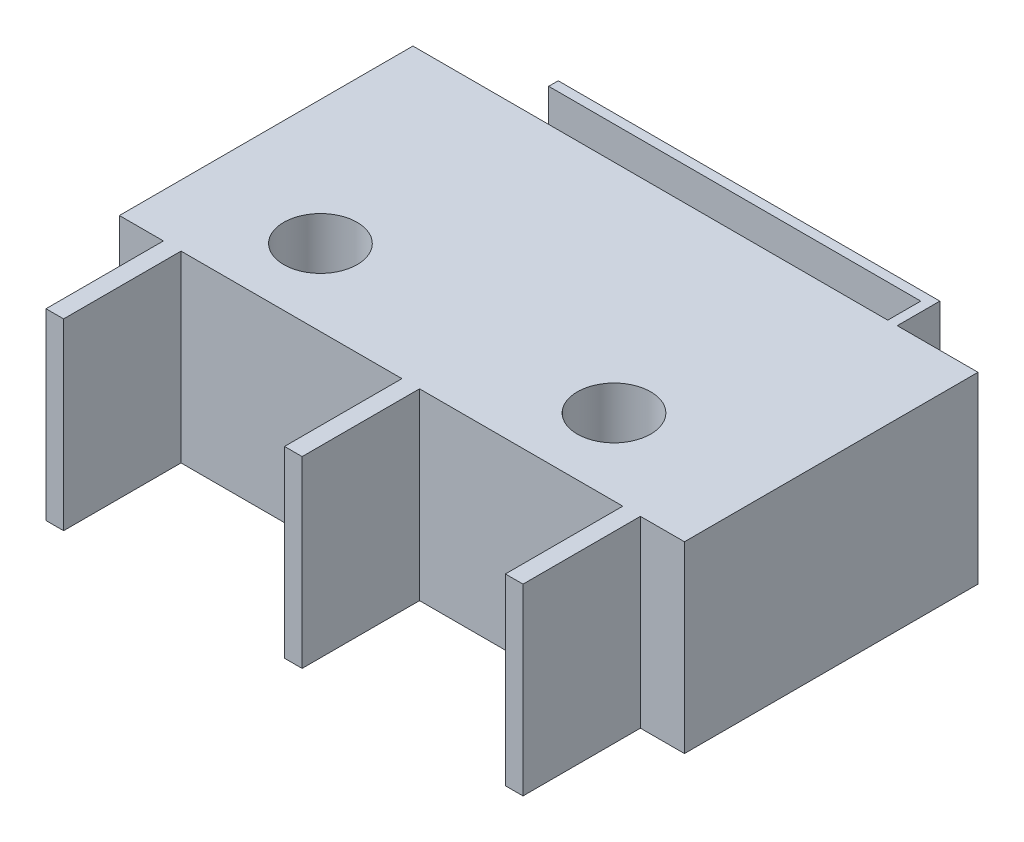
ISO-10303-21;
HEADER;
FILE_DESCRIPTION(('STEP AP214'),'2;1');
FILE_NAME('part.step','',(''),(''),'','','');
FILE_SCHEMA(('AUTOMOTIVE_DESIGN { 1 0 10303 214 1 1 1 1 }'));
ENDSEC;
DATA;
#1=APPLICATION_CONTEXT('core data for automotive mechanical design processes');
#2=APPLICATION_PROTOCOL_DEFINITION('international standard','automotive_design',2000,#1);
#3=PRODUCT_CONTEXT('',#1,'mechanical');
#4=PRODUCT('Part','Part','',(#3));
#5=PRODUCT_RELATED_PRODUCT_CATEGORY('part','',(#4));
#6=PRODUCT_DEFINITION_FORMATION('','',#4);
#7=PRODUCT_DEFINITION_CONTEXT('part definition',#1,'design');
#8=PRODUCT_DEFINITION('design','',#6,#7);
#9=PRODUCT_DEFINITION_SHAPE('','',#8);
#10=(LENGTH_UNIT() NAMED_UNIT(*) SI_UNIT(.MILLI.,.METRE.));
#11=(NAMED_UNIT(*) PLANE_ANGLE_UNIT() SI_UNIT($,.RADIAN.));
#12=(NAMED_UNIT(*) SI_UNIT($,.STERADIAN.) SOLID_ANGLE_UNIT());
#13=UNCERTAINTY_MEASURE_WITH_UNIT(LENGTH_MEASURE(1.E-05),#10,'distance_accuracy_value','');
#14=(GEOMETRIC_REPRESENTATION_CONTEXT(3) GLOBAL_UNCERTAINTY_ASSIGNED_CONTEXT((#13)) GLOBAL_UNIT_ASSIGNED_CONTEXT((#10,
#11,#12)) REPRESENTATION_CONTEXT('',''));
#15=CARTESIAN_POINT('',(0.,0.,0.));
#16=DIRECTION('',(0.,0.,1.));
#17=DIRECTION('',(1.,0.,0.));
#18=AXIS2_PLACEMENT_3D('',#15,#16,#17);
#19=CARTESIAN_POINT('',(0.313764077301954,6.35,-11.3770561101226));
#20=DIRECTION('',(0.,0.,-1.));
#21=DIRECTION('',(-1.,0.,0.));
#22=AXIS2_PLACEMENT_3D('',#19,#20,#21);
#23=PLANE('',#22);
#24=DIRECTION('',(1.,0.,0.));
#25=VECTOR('',#24,1.);
#26=CARTESIAN_POINT('',(0.313764077301954,6.35,-11.3770561101226));
#27=LINE('',#26,#25);
#28=CARTESIAN_POINT('',(0.313764077301954,6.35,-11.3770561101226));
#29=VERTEX_POINT('',#28);
#30=CARTESIAN_POINT('',(16.7475640773019,6.35,-11.3770561101226));
#31=VERTEX_POINT('',#30);
#32=EDGE_CURVE('E160',#29,#31,#27,.T.);
#33=ORIENTED_EDGE('',*,*,#32,.T.);
#34=DIRECTION('',(0.,-1.,0.));
#35=VECTOR('',#34,1.);
#36=CARTESIAN_POINT('',(16.7475640773019,6.35,-11.3770561101226));
#37=LINE('',#36,#35);
#38=CARTESIAN_POINT('',(16.7475640773019,0.,-11.3770561101226));
#39=VERTEX_POINT('',#38);
#40=EDGE_CURVE('E174',#31,#39,#37,.T.);
#41=ORIENTED_EDGE('',*,*,#40,.T.);
#42=DIRECTION('',(1.,0.,0.));
#43=VECTOR('',#42,1.);
#44=CARTESIAN_POINT('',(0.313764077301954,0.,-11.3770561101226));
#45=LINE('',#44,#43);
#46=CARTESIAN_POINT('',(0.313764077301954,0.,-11.3770561101226));
#47=VERTEX_POINT('',#46);
#48=EDGE_CURVE('E166',#47,#39,#45,.T.);
#49=ORIENTED_EDGE('',*,*,#48,.F.);
#50=DIRECTION('',(0.,-1.,0.));
#51=VECTOR('',#50,1.);
#52=CARTESIAN_POINT('',(0.313764077301954,6.35,-11.3770561101226));
#53=LINE('',#52,#51);
#54=EDGE_CURVE('E149',#29,#47,#53,.T.);
#55=ORIENTED_EDGE('',*,*,#54,.F.);
#56=EDGE_LOOP('',(#33,#41,#49,#55));
#57=FACE_BOUND('',#56,.T.);
#58=ADVANCED_FACE('F32',(#57),#23,.T.);
#59=CARTESIAN_POINT('',(17.738164077302,6.35,-1.2170561101226));
#60=DIRECTION('',(1.,0.,0.));
#61=DIRECTION('',(0.,0.,-1.));
#62=AXIS2_PLACEMENT_3D('',#59,#60,#61);
#63=PLANE('',#62);
#64=DIRECTION('',(0.,0.,1.));
#65=VECTOR('',#64,1.);
#66=CARTESIAN_POINT('',(17.738164077302,0.,-1.2170561101226));
#67=LINE('',#66,#65);
#68=CARTESIAN_POINT('',(17.738164077302,0.,-1.2170561101226));
#69=VERTEX_POINT('',#68);
#70=CARTESIAN_POINT('',(17.738164077302,0.,2.8469438898774));
#71=VERTEX_POINT('',#70);
#72=EDGE_CURVE('E234',#69,#71,#67,.T.);
#73=ORIENTED_EDGE('',*,*,#72,.T.);
#74=DIRECTION('',(0.,-1.,0.));
#75=VECTOR('',#74,1.);
#76=CARTESIAN_POINT('',(17.738164077302,6.35,2.8469438898774));
#77=LINE('',#76,#75);
#78=CARTESIAN_POINT('',(17.738164077302,6.35,2.8469438898774));
#79=VERTEX_POINT('',#78);
#80=EDGE_CURVE('E41',#79,#71,#77,.T.);
#81=ORIENTED_EDGE('',*,*,#80,.F.);
#82=DIRECTION('',(0.,0.,1.));
#83=VECTOR('',#82,1.);
#84=CARTESIAN_POINT('',(17.738164077302,6.35,-1.2170561101226));
#85=LINE('',#84,#83);
#86=CARTESIAN_POINT('',(17.738164077302,6.35,-1.2170561101226));
#87=VERTEX_POINT('',#86);
#88=EDGE_CURVE('E255',#87,#79,#85,.T.);
#89=ORIENTED_EDGE('',*,*,#88,.F.);
#90=DIRECTION('',(0.,-1.,0.));
#91=VECTOR('',#90,1.);
#92=CARTESIAN_POINT('',(17.738164077302,6.35,-1.2170561101226));
#93=LINE('',#92,#91);
#94=EDGE_CURVE('E11',#87,#69,#93,.T.);
#95=ORIENTED_EDGE('',*,*,#94,.T.);
#96=EDGE_LOOP('',(#73,#81,#89,#95));
#97=FACE_BOUND('',#96,.T.);
#98=ADVANCED_FACE('F423',(#97),#63,.F.);
#99=CARTESIAN_POINT('',(17.738164077302,6.35,2.8469438898774));
#100=DIRECTION('',(0.,0.,-1.));
#101=DIRECTION('',(-1.,0.,0.));
#102=AXIS2_PLACEMENT_3D('',#99,#100,#101);
#103=PLANE('',#102);
#104=DIRECTION('',(1.,0.,0.));
#105=VECTOR('',#104,1.);
#106=CARTESIAN_POINT('',(17.738164077302,0.,2.8469438898774));
#107=LINE('',#106,#105);
#108=CARTESIAN_POINT('',(18.347764077302,0.,2.8469438898774));
#109=VERTEX_POINT('',#108);
#110=EDGE_CURVE('E237',#71,#109,#107,.T.);
#111=ORIENTED_EDGE('',*,*,#110,.T.);
#112=DIRECTION('',(0.,-1.,0.));
#113=VECTOR('',#112,1.);
#114=CARTESIAN_POINT('',(18.347764077302,6.35,2.8469438898774));
#115=LINE('',#114,#113);
#116=CARTESIAN_POINT('',(18.347764077302,6.35,2.8469438898774));
#117=VERTEX_POINT('',#116);
#118=EDGE_CURVE('E251',#117,#109,#115,.T.);
#119=ORIENTED_EDGE('',*,*,#118,.F.);
#120=DIRECTION('',(1.,0.,0.));
#121=VECTOR('',#120,1.);
#122=CARTESIAN_POINT('',(17.738164077302,6.35,2.8469438898774));
#123=LINE('',#122,#121);
#124=EDGE_CURVE('E244',#79,#117,#123,.T.);
#125=ORIENTED_EDGE('',*,*,#124,.F.);
#126=ORIENTED_EDGE('',*,*,#80,.T.);
#127=EDGE_LOOP('',(#111,#119,#125,#126));
#128=FACE_BOUND('',#127,.T.);
#129=ADVANCED_FACE('F350',(#128),#103,.F.);
#130=CARTESIAN_POINT('',(18.347764077302,6.35,-1.2170561101226));
#131=DIRECTION('',(1.,0.,0.));
#132=DIRECTION('',(0.,0.,-1.));
#133=AXIS2_PLACEMENT_3D('',#130,#131,#132);
#134=PLANE('',#133);
#135=DIRECTION('',(0.,0.,1.));
#136=VECTOR('',#135,1.);
#137=CARTESIAN_POINT('',(18.347764077302,0.,-1.2170561101226));
#138=LINE('',#137,#136);
#139=CARTESIAN_POINT('',(18.347764077302,0.,-1.2170561101226));
#140=VERTEX_POINT('',#139);
#141=EDGE_CURVE('E246',#140,#109,#138,.T.);
#142=ORIENTED_EDGE('',*,*,#141,.F.);
#143=DIRECTION('',(0.,-1.,0.));
#144=VECTOR('',#143,1.);
#145=CARTESIAN_POINT('',(18.347764077302,6.35,-1.2170561101226));
#146=LINE('',#145,#144);
#147=CARTESIAN_POINT('',(18.347764077302,6.35,-1.2170561101226));
#148=VERTEX_POINT('',#147);
#149=EDGE_CURVE('E253',#148,#140,#146,.T.);
#150=ORIENTED_EDGE('',*,*,#149,.F.);
#151=DIRECTION('',(0.,0.,1.));
#152=VECTOR('',#151,1.);
#153=CARTESIAN_POINT('',(18.347764077302,6.35,-1.2170561101226));
#154=LINE('',#153,#152);
#155=EDGE_CURVE('E241',#148,#117,#154,.T.);
#156=ORIENTED_EDGE('',*,*,#155,.T.);
#157=ORIENTED_EDGE('',*,*,#118,.T.);
#158=EDGE_LOOP('',(#142,#150,#156,#157));
#159=FACE_BOUND('',#158,.T.);
#160=ADVANCED_FACE('F353',(#159),#134,.T.);
#161=CARTESIAN_POINT('',(0.,0.,0.));
#162=DIRECTION('',(0.,-1.,0.));
#163=DIRECTION('',(0.,0.,-1.));
#164=AXIS2_PLACEMENT_3D('',#161,#162,#163);
#165=PLANE('',#164);
#166=CARTESIAN_POINT('',(4.63176407730195,0.,-3.85841360171425));
#167=DIRECTION('',(0.,1.,0.));
#168=DIRECTION('',(0.,0.,1.));
#169=AXIS2_PLACEMENT_3D('',#166,#167,#168);
#170=CIRCLE('',#169,1.27);
#171=CARTESIAN_POINT('',(4.63176407730195,0.,-2.58841360171425));
#172=VERTEX_POINT('',#171);
#173=EDGE_CURVE('E172',#172,#172,#170,.T.);
#174=ORIENTED_EDGE('',*,*,#173,.T.);
#175=EDGE_LOOP('',(#174));
#176=FACE_BOUND('',#175,.T.);
#177=CARTESIAN_POINT('',(14.791764077302,0.,-3.85841360171425));
#178=DIRECTION('',(0.,1.,0.));
#179=DIRECTION('',(0.,0.,1.));
#180=AXIS2_PLACEMENT_3D('',#177,#178,#179);
#181=CIRCLE('',#180,1.27);
#182=CARTESIAN_POINT('',(14.791764077302,0.,-2.58841360171425));
#183=VERTEX_POINT('',#182);
#184=EDGE_CURVE('E396',#183,#183,#181,.T.);
#185=ORIENTED_EDGE('',*,*,#184,.T.);
#186=EDGE_LOOP('',(#185));
#187=FACE_BOUND('',#186,.T.);
#188=ORIENTED_EDGE('',*,*,#72,.F.);
#189=DIRECTION('',(1.,0.,0.));
#190=VECTOR('',#189,1.);
#191=CARTESIAN_POINT('',(0.313764077301955,0.,-1.2170561101226));
#192=LINE('',#191,#190);
#193=CARTESIAN_POINT('',(10.702364077302,0.,-1.2170561101226));
#194=VERTEX_POINT('',#193);
#195=EDGE_CURVE('E225',#194,#69,#192,.T.);
#196=ORIENTED_EDGE('',*,*,#195,.F.);
#197=DIRECTION('',(0.,0.,1.));
#198=VECTOR('',#197,1.);
#199=CARTESIAN_POINT('',(10.702364077302,0.,-1.2170561101226));
#200=LINE('',#199,#198);
#201=CARTESIAN_POINT('',(10.702364077302,0.,2.8469438898774));
#202=VERTEX_POINT('',#201);
#203=EDGE_CURVE('E209',#194,#202,#200,.T.);
#204=ORIENTED_EDGE('',*,*,#203,.T.);
#205=DIRECTION('',(1.,0.,0.));
#206=VECTOR('',#205,1.);
#207=CARTESIAN_POINT('',(10.092764077302,0.,2.8469438898774));
#208=LINE('',#207,#206);
#209=CARTESIAN_POINT('',(10.092764077302,0.,2.8469438898774));
#210=VERTEX_POINT('',#209);
#211=EDGE_CURVE('E265',#210,#202,#208,.T.);
#212=ORIENTED_EDGE('',*,*,#211,.F.);
#213=DIRECTION('',(0.,0.,1.));
#214=VECTOR('',#213,1.);
#215=CARTESIAN_POINT('',(10.092764077302,0.,-1.2170561101226));
#216=LINE('',#215,#214);
#217=CARTESIAN_POINT('',(10.092764077302,0.,-1.2170561101226));
#218=VERTEX_POINT('',#217);
#219=EDGE_CURVE('E260',#218,#210,#216,.T.);
#220=ORIENTED_EDGE('',*,*,#219,.F.);
#221=CARTESIAN_POINT('',(2.44736407730195,0.,-1.2170561101226));
#222=VERTEX_POINT('',#221);
#223=EDGE_CURVE('E223',#222,#218,#192,.T.);
#224=ORIENTED_EDGE('',*,*,#223,.F.);
#225=DIRECTION('',(0.,0.,-1.));
#226=VECTOR('',#225,1.);
#227=CARTESIAN_POINT('',(2.44736407730195,0.,2.8469438898774));
#228=LINE('',#227,#226);
#229=CARTESIAN_POINT('',(2.44736407730195,0.,2.8469438898774));
#230=VERTEX_POINT('',#229);
#231=EDGE_CURVE('E198',#230,#222,#228,.T.);
#232=ORIENTED_EDGE('',*,*,#231,.F.);
#233=DIRECTION('',(-1.,0.,0.));
#234=VECTOR('',#233,1.);
#235=CARTESIAN_POINT('',(2.44736407730195,0.,2.8469438898774));
#236=LINE('',#235,#234);
#237=CARTESIAN_POINT('',(1.83776407730196,0.,2.8469438898774));
#238=VERTEX_POINT('',#237);
#239=EDGE_CURVE('E191',#230,#238,#236,.T.);
#240=ORIENTED_EDGE('',*,*,#239,.T.);
#241=DIRECTION('',(0.,0.,-1.));
#242=VECTOR('',#241,1.);
#243=CARTESIAN_POINT('',(1.83776407730196,0.,2.8469438898774));
#244=LINE('',#243,#242);
#245=CARTESIAN_POINT('',(1.83776407730196,0.,-1.2170561101226));
#246=VERTEX_POINT('',#245);
#247=EDGE_CURVE('E194',#238,#246,#244,.T.);
#248=ORIENTED_EDGE('',*,*,#247,.T.);
#249=CARTESIAN_POINT('',(0.313764077301955,0.,-1.2170561101226));
#250=VERTEX_POINT('',#249);
#251=EDGE_CURVE('E169',#250,#246,#192,.T.);
#252=ORIENTED_EDGE('',*,*,#251,.F.);
#253=DIRECTION('',(0.,0.,1.));
#254=VECTOR('',#253,1.);
#255=CARTESIAN_POINT('',(0.313764077301954,0.,-11.3770561101226));
#256=LINE('',#255,#254);
#257=EDGE_CURVE('E152',#47,#250,#256,.T.);
#258=ORIENTED_EDGE('',*,*,#257,.F.);
#259=ORIENTED_EDGE('',*,*,#48,.T.);
#260=DIRECTION('',(0.,0.,-1.));
#261=VECTOR('',#260,1.);
#262=CARTESIAN_POINT('',(16.7475640773019,0.,-11.3770561101226));
#263=LINE('',#262,#261);
#264=CARTESIAN_POINT('',(16.7475640773019,0.,-12.5200561101226));
#265=VERTEX_POINT('',#264);
#266=EDGE_CURVE('E49',#39,#265,#263,.T.);
#267=ORIENTED_EDGE('',*,*,#266,.T.);
#268=DIRECTION('',(-1.,0.,0.));
#269=VECTOR('',#268,1.);
#270=CARTESIAN_POINT('',(17.0777640773019,0.,-12.5200561101226));
#271=LINE('',#270,#269);
#272=CARTESIAN_POINT('',(3.86976407730195,0.,-12.5200561101226));
#273=VERTEX_POINT('',#272);
#274=EDGE_CURVE('E378',#265,#273,#271,.T.);
#275=ORIENTED_EDGE('',*,*,#274,.T.);
#276=DIRECTION('',(0.,0.,-1.));
#277=VECTOR('',#276,1.);
#278=CARTESIAN_POINT('',(3.86976407730195,0.,-12.5200561101226));
#279=LINE('',#278,#277);
#280=CARTESIAN_POINT('',(3.86976407730195,0.,-12.8502561101226));
#281=VERTEX_POINT('',#280);
#282=EDGE_CURVE('E385',#273,#281,#279,.T.);
#283=ORIENTED_EDGE('',*,*,#282,.T.);
#284=DIRECTION('',(-1.,0.,0.));
#285=VECTOR('',#284,1.);
#286=CARTESIAN_POINT('',(17.0777640773019,0.,-12.8502561101226));
#287=LINE('',#286,#285);
#288=CARTESIAN_POINT('',(17.0777640773019,0.,-12.8502561101226));
#289=VERTEX_POINT('',#288);
#290=EDGE_CURVE('E359',#289,#281,#287,.T.);
#291=ORIENTED_EDGE('',*,*,#290,.F.);
#292=DIRECTION('',(0.,0.,-1.));
#293=VECTOR('',#292,1.);
#294=CARTESIAN_POINT('',(17.0777640773019,0.,-11.3770561101226));
#295=LINE('',#294,#293);
#296=CARTESIAN_POINT('',(17.0777640773019,0.,-11.3770561101226));
#297=VERTEX_POINT('',#296);
#298=EDGE_CURVE('E356',#297,#289,#295,.T.);
#299=ORIENTED_EDGE('',*,*,#298,.F.);
#300=CARTESIAN_POINT('',(19.871764077302,0.,-11.3770561101226));
#301=VERTEX_POINT('',#300);
#302=EDGE_CURVE('E175',#297,#301,#45,.T.);
#303=ORIENTED_EDGE('',*,*,#302,.T.);
#304=DIRECTION('',(0.,0.,1.));
#305=VECTOR('',#304,1.);
#306=CARTESIAN_POINT('',(19.871764077302,0.,-11.3770561101226));
#307=LINE('',#306,#305);
#308=CARTESIAN_POINT('',(19.871764077302,0.,-1.2170561101226));
#309=VERTEX_POINT('',#308);
#310=EDGE_CURVE('E179',#301,#309,#307,.T.);
#311=ORIENTED_EDGE('',*,*,#310,.T.);
#312=EDGE_CURVE('E171',#140,#309,#192,.T.);
#313=ORIENTED_EDGE('',*,*,#312,.F.);
#314=ORIENTED_EDGE('',*,*,#141,.T.);
#315=ORIENTED_EDGE('',*,*,#110,.F.);
#316=EDGE_LOOP('',(#188,#196,#204,#212,#220,#224,#232,#240,#248,#252,#258,#259,#267,#275,#283,
#291,#299,#303,#311,#313,#314,#315));
#317=FACE_BOUND('',#316,.T.);
#318=ADVANCED_FACE('F165',(#176,#187,#317),#165,.T.);
#319=CARTESIAN_POINT('',(0.,6.35,0.));
#320=DIRECTION('',(0.,-1.,0.));
#321=DIRECTION('',(0.,0.,-1.));
#322=AXIS2_PLACEMENT_3D('',#319,#320,#321);
#323=PLANE('',#322);
#324=CARTESIAN_POINT('',(4.63176407730195,6.35,-3.85841360171425));
#325=DIRECTION('',(0.,1.,0.));
#326=DIRECTION('',(0.,0.,1.));
#327=AXIS2_PLACEMENT_3D('',#324,#325,#326);
#328=CIRCLE('',#327,1.27);
#329=CARTESIAN_POINT('',(4.63176407730195,6.35,-2.58841360171425));
#330=VERTEX_POINT('',#329);
#331=EDGE_CURVE('E393',#330,#330,#328,.T.);
#332=ORIENTED_EDGE('',*,*,#331,.F.);
#333=EDGE_LOOP('',(#332));
#334=FACE_BOUND('',#333,.T.);
#335=CARTESIAN_POINT('',(14.791764077302,6.35,-3.85841360171425));
#336=DIRECTION('',(0.,1.,0.));
#337=DIRECTION('',(0.,0.,1.));
#338=AXIS2_PLACEMENT_3D('',#335,#336,#337);
#339=CIRCLE('',#338,1.27);
#340=CARTESIAN_POINT('',(14.791764077302,6.35,-2.58841360171425));
#341=VERTEX_POINT('',#340);
#342=EDGE_CURVE('E374',#341,#341,#339,.T.);
#343=ORIENTED_EDGE('',*,*,#342,.F.);
#344=EDGE_LOOP('',(#343));
#345=FACE_BOUND('',#344,.T.);
#346=ORIENTED_EDGE('',*,*,#155,.F.);
#347=DIRECTION('',(1.,0.,0.));
#348=VECTOR('',#347,1.);
#349=CARTESIAN_POINT('',(0.313764077301955,6.35,-1.2170561101226));
#350=LINE('',#349,#348);
#351=CARTESIAN_POINT('',(19.871764077302,6.35,-1.2170561101226));
#352=VERTEX_POINT('',#351);
#353=EDGE_CURVE('E177',#148,#352,#350,.T.);
#354=ORIENTED_EDGE('',*,*,#353,.T.);
#355=DIRECTION('',(0.,0.,1.));
#356=VECTOR('',#355,1.);
#357=CARTESIAN_POINT('',(19.871764077302,6.35,-11.3770561101226));
#358=LINE('',#357,#356);
#359=CARTESIAN_POINT('',(19.871764077302,6.35,-11.3770561101226));
#360=VERTEX_POINT('',#359);
#361=EDGE_CURVE('E219',#360,#352,#358,.T.);
#362=ORIENTED_EDGE('',*,*,#361,.F.);
#363=CARTESIAN_POINT('',(17.0777640773019,6.35,-11.3770561101226));
#364=VERTEX_POINT('',#363);
#365=EDGE_CURVE('E222',#364,#360,#27,.T.);
#366=ORIENTED_EDGE('',*,*,#365,.F.);
#367=DIRECTION('',(0.,0.,-1.));
#368=VECTOR('',#367,1.);
#369=CARTESIAN_POINT('',(17.0777640773019,6.35,-11.3770561101226));
#370=LINE('',#369,#368);
#371=CARTESIAN_POINT('',(17.0777640773019,6.35,-12.8502561101226));
#372=VERTEX_POINT('',#371);
#373=EDGE_CURVE('E317',#364,#372,#370,.T.);
#374=ORIENTED_EDGE('',*,*,#373,.T.);
#375=DIRECTION('',(-1.,0.,0.));
#376=VECTOR('',#375,1.);
#377=CARTESIAN_POINT('',(17.0777640773019,6.35,-12.8502561101226));
#378=LINE('',#377,#376);
#379=CARTESIAN_POINT('',(3.86976407730195,6.35,-12.8502561101226));
#380=VERTEX_POINT('',#379);
#381=EDGE_CURVE('E375',#372,#380,#378,.T.);
#382=ORIENTED_EDGE('',*,*,#381,.T.);
#383=DIRECTION('',(0.,0.,-1.));
#384=VECTOR('',#383,1.);
#385=CARTESIAN_POINT('',(3.86976407730195,6.35,-12.5200561101226));
#386=LINE('',#385,#384);
#387=CARTESIAN_POINT('',(3.86976407730195,6.35,-12.5200561101226));
#388=VERTEX_POINT('',#387);
#389=EDGE_CURVE('E377',#388,#380,#386,.T.);
#390=ORIENTED_EDGE('',*,*,#389,.F.);
#391=DIRECTION('',(-1.,0.,0.));
#392=VECTOR('',#391,1.);
#393=CARTESIAN_POINT('',(17.0777640773019,6.35,-12.5200561101226));
#394=LINE('',#393,#392);
#395=CARTESIAN_POINT('',(16.7475640773019,6.35,-12.5200561101226));
#396=VERTEX_POINT('',#395);
#397=EDGE_CURVE('E381',#396,#388,#394,.T.);
#398=ORIENTED_EDGE('',*,*,#397,.F.);
#399=DIRECTION('',(0.,0.,-1.));
#400=VECTOR('',#399,1.);
#401=CARTESIAN_POINT('',(16.7475640773019,6.35,-11.3770561101226));
#402=LINE('',#401,#400);
#403=EDGE_CURVE('E367',#31,#396,#402,.T.);
#404=ORIENTED_EDGE('',*,*,#403,.F.);
#405=ORIENTED_EDGE('',*,*,#32,.F.);
#406=DIRECTION('',(0.,0.,1.));
#407=VECTOR('',#406,1.);
#408=CARTESIAN_POINT('',(0.313764077301954,6.35,-11.3770561101226));
#409=LINE('',#408,#407);
#410=CARTESIAN_POINT('',(0.313764077301955,6.35,-1.2170561101226));
#411=VERTEX_POINT('',#410);
#412=EDGE_CURVE('E154',#29,#411,#409,.T.);
#413=ORIENTED_EDGE('',*,*,#412,.T.);
#414=CARTESIAN_POINT('',(1.83776407730196,6.35,-1.2170561101226));
#415=VERTEX_POINT('',#414);
#416=EDGE_CURVE('E216',#411,#415,#350,.T.);
#417=ORIENTED_EDGE('',*,*,#416,.T.);
#418=DIRECTION('',(0.,0.,-1.));
#419=VECTOR('',#418,1.);
#420=CARTESIAN_POINT('',(1.83776407730196,6.35,2.8469438898774));
#421=LINE('',#420,#419);
#422=CARTESIAN_POINT('',(1.83776407730196,6.35,2.8469438898774));
#423=VERTEX_POINT('',#422);
#424=EDGE_CURVE('E278',#423,#415,#421,.T.);
#425=ORIENTED_EDGE('',*,*,#424,.F.);
#426=DIRECTION('',(-1.,0.,0.));
#427=VECTOR('',#426,1.);
#428=CARTESIAN_POINT('',(2.44736407730195,6.35,2.8469438898774));
#429=LINE('',#428,#427);
#430=CARTESIAN_POINT('',(2.44736407730195,6.35,2.8469438898774));
#431=VERTEX_POINT('',#430);
#432=EDGE_CURVE('E206',#431,#423,#429,.T.);
#433=ORIENTED_EDGE('',*,*,#432,.F.);
#434=DIRECTION('',(0.,0.,-1.));
#435=VECTOR('',#434,1.);
#436=CARTESIAN_POINT('',(2.44736407730195,6.35,2.8469438898774));
#437=LINE('',#436,#435);
#438=CARTESIAN_POINT('',(2.44736407730195,6.35,-1.2170561101226));
#439=VERTEX_POINT('',#438);
#440=EDGE_CURVE('E201',#431,#439,#437,.T.);
#441=ORIENTED_EDGE('',*,*,#440,.T.);
#442=CARTESIAN_POINT('',(10.092764077302,6.35,-1.2170561101226));
#443=VERTEX_POINT('',#442);
#444=EDGE_CURVE('E220',#439,#443,#350,.T.);
#445=ORIENTED_EDGE('',*,*,#444,.T.);
#446=DIRECTION('',(0.,0.,1.));
#447=VECTOR('',#446,1.);
#448=CARTESIAN_POINT('',(10.092764077302,6.35,-1.2170561101226));
#449=LINE('',#448,#447);
#450=CARTESIAN_POINT('',(10.092764077302,6.35,2.8469438898774));
#451=VERTEX_POINT('',#450);
#452=EDGE_CURVE('E262',#443,#451,#449,.T.);
#453=ORIENTED_EDGE('',*,*,#452,.T.);
#454=DIRECTION('',(1.,0.,0.));
#455=VECTOR('',#454,1.);
#456=CARTESIAN_POINT('',(10.092764077302,6.35,2.8469438898774));
#457=LINE('',#456,#455);
#458=CARTESIAN_POINT('',(10.702364077302,6.35,2.8469438898774));
#459=VERTEX_POINT('',#458);
#460=EDGE_CURVE('E259',#451,#459,#457,.T.);
#461=ORIENTED_EDGE('',*,*,#460,.T.);
#462=DIRECTION('',(0.,0.,1.));
#463=VECTOR('',#462,1.);
#464=CARTESIAN_POINT('',(10.702364077302,6.35,-1.2170561101226));
#465=LINE('',#464,#463);
#466=CARTESIAN_POINT('',(10.702364077302,6.35,-1.2170561101226));
#467=VERTEX_POINT('',#466);
#468=EDGE_CURVE('E256',#467,#459,#465,.T.);
#469=ORIENTED_EDGE('',*,*,#468,.F.);
#470=EDGE_CURVE('E296',#467,#87,#350,.T.);
#471=ORIENTED_EDGE('',*,*,#470,.T.);
#472=ORIENTED_EDGE('',*,*,#88,.T.);
#473=ORIENTED_EDGE('',*,*,#124,.T.);
#474=EDGE_LOOP('',(#346,#354,#362,#366,#374,#382,#390,#398,#404,#405,#413,#417,#425,#433,#441,
#445,#453,#461,#469,#471,#472,#473));
#475=FACE_BOUND('',#474,.T.);
#476=ADVANCED_FACE('F288',(#334,#345,#475),#323,.F.);
#477=CARTESIAN_POINT('',(1.83776407730196,6.35,2.8469438898774));
#478=DIRECTION('',(-1.,0.,0.));
#479=DIRECTION('',(0.,0.,1.));
#480=AXIS2_PLACEMENT_3D('',#477,#478,#479);
#481=PLANE('',#480);
#482=ORIENTED_EDGE('',*,*,#247,.F.);
#483=DIRECTION('',(0.,-1.,0.));
#484=VECTOR('',#483,1.);
#485=CARTESIAN_POINT('',(1.83776407730196,6.35,2.8469438898774));
#486=LINE('',#485,#484);
#487=EDGE_CURVE('E214',#423,#238,#486,.T.);
#488=ORIENTED_EDGE('',*,*,#487,.F.);
#489=ORIENTED_EDGE('',*,*,#424,.T.);
#490=DIRECTION('',(0.,-1.,0.));
#491=VECTOR('',#490,1.);
#492=CARTESIAN_POINT('',(1.83776407730196,6.35,-1.2170561101226));
#493=LINE('',#492,#491);
#494=EDGE_CURVE('E212',#415,#246,#493,.T.);
#495=ORIENTED_EDGE('',*,*,#494,.T.);
#496=EDGE_LOOP('',(#482,#488,#489,#495));
#497=FACE_BOUND('',#496,.T.);
#498=ADVANCED_FACE('F406',(#497),#481,.T.);
#499=CARTESIAN_POINT('',(2.44736407730195,6.35,2.8469438898774));
#500=DIRECTION('',(0.,0.,1.));
#501=DIRECTION('',(1.,0.,0.));
#502=AXIS2_PLACEMENT_3D('',#499,#500,#501);
#503=PLANE('',#502);
#504=ORIENTED_EDGE('',*,*,#239,.F.);
#505=DIRECTION('',(0.,-1.,0.));
#506=VECTOR('',#505,1.);
#507=CARTESIAN_POINT('',(2.44736407730195,6.35,2.8469438898774));
#508=LINE('',#507,#506);
#509=EDGE_CURVE('E207',#431,#230,#508,.T.);
#510=ORIENTED_EDGE('',*,*,#509,.F.);
#511=ORIENTED_EDGE('',*,*,#432,.T.);
#512=ORIENTED_EDGE('',*,*,#487,.T.);
#513=EDGE_LOOP('',(#504,#510,#511,#512));
#514=FACE_BOUND('',#513,.T.);
#515=ADVANCED_FACE('F413',(#514),#503,.T.);
#516=CARTESIAN_POINT('',(2.44736407730195,6.35,2.8469438898774));
#517=DIRECTION('',(-1.,0.,0.));
#518=DIRECTION('',(0.,0.,1.));
#519=AXIS2_PLACEMENT_3D('',#516,#517,#518);
#520=PLANE('',#519);
#521=ORIENTED_EDGE('',*,*,#231,.T.);
#522=DIRECTION('',(0.,-1.,0.));
#523=VECTOR('',#522,1.);
#524=CARTESIAN_POINT('',(2.44736407730195,6.35,-1.2170561101226));
#525=LINE('',#524,#523);
#526=EDGE_CURVE('E210',#439,#222,#525,.T.);
#527=ORIENTED_EDGE('',*,*,#526,.F.);
#528=ORIENTED_EDGE('',*,*,#440,.F.);
#529=ORIENTED_EDGE('',*,*,#509,.T.);
#530=EDGE_LOOP('',(#521,#527,#528,#529));
#531=FACE_BOUND('',#530,.T.);
#532=ADVANCED_FACE('F292',(#531),#520,.F.);
#533=CARTESIAN_POINT('',(10.092764077302,6.35,-1.2170561101226));
#534=DIRECTION('',(1.,0.,0.));
#535=DIRECTION('',(0.,0.,-1.));
#536=AXIS2_PLACEMENT_3D('',#533,#534,#535);
#537=PLANE('',#536);
#538=ORIENTED_EDGE('',*,*,#219,.T.);
#539=DIRECTION('',(0.,-1.,0.));
#540=VECTOR('',#539,1.);
#541=CARTESIAN_POINT('',(10.092764077302,6.35,2.8469438898774));
#542=LINE('',#541,#540);
#543=EDGE_CURVE('E271',#451,#210,#542,.T.);
#544=ORIENTED_EDGE('',*,*,#543,.F.);
#545=ORIENTED_EDGE('',*,*,#452,.F.);
#546=DIRECTION('',(0.,-1.,0.));
#547=VECTOR('',#546,1.);
#548=CARTESIAN_POINT('',(10.092764077302,6.35,-1.2170561101226));
#549=LINE('',#548,#547);
#550=EDGE_CURVE('E269',#443,#218,#549,.T.);
#551=ORIENTED_EDGE('',*,*,#550,.T.);
#552=EDGE_LOOP('',(#538,#544,#545,#551));
#553=FACE_BOUND('',#552,.T.);
#554=ADVANCED_FACE('F421',(#553),#537,.F.);
#555=CARTESIAN_POINT('',(10.092764077302,6.35,2.8469438898774));
#556=DIRECTION('',(0.,0.,-1.));
#557=DIRECTION('',(-1.,0.,0.));
#558=AXIS2_PLACEMENT_3D('',#555,#556,#557);
#559=PLANE('',#558);
#560=ORIENTED_EDGE('',*,*,#211,.T.);
#561=DIRECTION('',(0.,-1.,0.));
#562=VECTOR('',#561,1.);
#563=CARTESIAN_POINT('',(10.702364077302,6.35,2.8469438898774));
#564=LINE('',#563,#562);
#565=EDGE_CURVE('E274',#459,#202,#564,.T.);
#566=ORIENTED_EDGE('',*,*,#565,.F.);
#567=ORIENTED_EDGE('',*,*,#460,.F.);
#568=ORIENTED_EDGE('',*,*,#543,.T.);
#569=EDGE_LOOP('',(#560,#566,#567,#568));
#570=FACE_BOUND('',#569,.T.);
#571=ADVANCED_FACE('F446',(#570),#559,.F.);
#572=CARTESIAN_POINT('',(10.702364077302,6.35,-1.2170561101226));
#573=DIRECTION('',(1.,0.,0.));
#574=DIRECTION('',(0.,0.,-1.));
#575=AXIS2_PLACEMENT_3D('',#572,#573,#574);
#576=PLANE('',#575);
#577=ORIENTED_EDGE('',*,*,#203,.F.);
#578=DIRECTION('',(0.,-1.,0.));
#579=VECTOR('',#578,1.);
#580=CARTESIAN_POINT('',(10.702364077302,6.35,-1.2170561101226));
#581=LINE('',#580,#579);
#582=EDGE_CURVE('E230',#467,#194,#581,.T.);
#583=ORIENTED_EDGE('',*,*,#582,.F.);
#584=ORIENTED_EDGE('',*,*,#468,.T.);
#585=ORIENTED_EDGE('',*,*,#565,.T.);
#586=EDGE_LOOP('',(#577,#583,#584,#585));
#587=FACE_BOUND('',#586,.T.);
#588=ADVANCED_FACE('F443',(#587),#576,.T.);
#589=CARTESIAN_POINT('',(0.313764077301955,6.35,-1.2170561101226));
#590=DIRECTION('',(0.,0.,-1.));
#591=DIRECTION('',(-1.,0.,0.));
#592=AXIS2_PLACEMENT_3D('',#589,#590,#591);
#593=PLANE('',#592);
#594=ORIENTED_EDGE('',*,*,#494,.F.);
#595=ORIENTED_EDGE('',*,*,#416,.F.);
#596=DIRECTION('',(0.,-1.,0.));
#597=VECTOR('',#596,1.);
#598=CARTESIAN_POINT('',(0.313764077301955,6.35,-1.2170561101226));
#599=LINE('',#598,#597);
#600=EDGE_CURVE('E36',#411,#250,#599,.T.);
#601=ORIENTED_EDGE('',*,*,#600,.T.);
#602=ORIENTED_EDGE('',*,*,#251,.T.);
#603=EDGE_LOOP('',(#594,#595,#601,#602));
#604=FACE_BOUND('',#603,.T.);
#605=ADVANCED_FACE('F420',(#604),#593,.F.);
#606=ORIENTED_EDGE('',*,*,#223,.T.);
#607=ORIENTED_EDGE('',*,*,#550,.F.);
#608=ORIENTED_EDGE('',*,*,#444,.F.);
#609=ORIENTED_EDGE('',*,*,#526,.T.);
#610=EDGE_LOOP('',(#606,#607,#608,#609));
#611=FACE_BOUND('',#610,.T.);
#612=ADVANCED_FACE('F295',(#611),#593,.F.);
#613=ORIENTED_EDGE('',*,*,#195,.T.);
#614=ORIENTED_EDGE('',*,*,#94,.F.);
#615=ORIENTED_EDGE('',*,*,#470,.F.);
#616=ORIENTED_EDGE('',*,*,#582,.T.);
#617=EDGE_LOOP('',(#613,#614,#615,#616));
#618=FACE_BOUND('',#617,.T.);
#619=ADVANCED_FACE('F229',(#618),#593,.F.);
#620=ORIENTED_EDGE('',*,*,#149,.T.);
#621=ORIENTED_EDGE('',*,*,#312,.T.);
#622=DIRECTION('',(0.,-1.,0.));
#623=VECTOR('',#622,1.);
#624=CARTESIAN_POINT('',(19.871764077302,6.35,-1.2170561101226));
#625=LINE('',#624,#623);
#626=EDGE_CURVE('E184',#352,#309,#625,.T.);
#627=ORIENTED_EDGE('',*,*,#626,.F.);
#628=ORIENTED_EDGE('',*,*,#353,.F.);
#629=EDGE_LOOP('',(#620,#621,#627,#628));
#630=FACE_BOUND('',#629,.T.);
#631=ADVANCED_FACE('F303',(#630),#593,.F.);
#632=CARTESIAN_POINT('',(19.871764077302,6.35,-11.3770561101226));
#633=DIRECTION('',(1.,0.,0.));
#634=DIRECTION('',(0.,0.,-1.));
#635=AXIS2_PLACEMENT_3D('',#632,#633,#634);
#636=PLANE('',#635);
#637=ORIENTED_EDGE('',*,*,#310,.F.);
#638=DIRECTION('',(0.,-1.,0.));
#639=VECTOR('',#638,1.);
#640=CARTESIAN_POINT('',(19.871764077302,6.35,-11.3770561101226));
#641=LINE('',#640,#639);
#642=EDGE_CURVE('E159',#360,#301,#641,.T.);
#643=ORIENTED_EDGE('',*,*,#642,.F.);
#644=ORIENTED_EDGE('',*,*,#361,.T.);
#645=ORIENTED_EDGE('',*,*,#626,.T.);
#646=EDGE_LOOP('',(#637,#643,#644,#645));
#647=FACE_BOUND('',#646,.T.);
#648=ADVANCED_FACE('F305',(#647),#636,.T.);
#649=DIRECTION('',(0.,-1.,0.));
#650=VECTOR('',#649,1.);
#651=CARTESIAN_POINT('',(17.0777640773019,6.35,-11.3770561101226));
#652=LINE('',#651,#650);
#653=EDGE_CURVE('E312',#364,#297,#652,.T.);
#654=ORIENTED_EDGE('',*,*,#653,.F.);
#655=ORIENTED_EDGE('',*,*,#365,.T.);
#656=ORIENTED_EDGE('',*,*,#642,.T.);
#657=ORIENTED_EDGE('',*,*,#302,.F.);
#658=EDGE_LOOP('',(#654,#655,#656,#657));
#659=FACE_BOUND('',#658,.T.);
#660=ADVANCED_FACE('F309',(#659),#23,.T.);
#661=CARTESIAN_POINT('',(0.313764077301954,6.35,-11.3770561101226));
#662=DIRECTION('',(1.,0.,0.));
#663=DIRECTION('',(0.,0.,-1.));
#664=AXIS2_PLACEMENT_3D('',#661,#662,#663);
#665=PLANE('',#664);
#666=ORIENTED_EDGE('',*,*,#257,.T.);
#667=ORIENTED_EDGE('',*,*,#600,.F.);
#668=ORIENTED_EDGE('',*,*,#412,.F.);
#669=ORIENTED_EDGE('',*,*,#54,.T.);
#670=EDGE_LOOP('',(#666,#667,#668,#669));
#671=FACE_BOUND('',#670,.T.);
#672=ADVANCED_FACE('F34',(#671),#665,.F.);
#673=CARTESIAN_POINT('',(14.791764077302,0.,-3.85841360171425));
#674=DIRECTION('',(0.,1.,0.));
#675=DIRECTION('',(0.,0.,1.));
#676=AXIS2_PLACEMENT_3D('',#673,#674,#675);
#677=CYLINDRICAL_SURFACE('',#676,1.27);
#678=ORIENTED_EDGE('',*,*,#184,.F.);
#679=EDGE_LOOP('',(#678));
#680=FACE_BOUND('',#679,.T.);
#681=ORIENTED_EDGE('',*,*,#342,.T.);
#682=EDGE_LOOP('',(#681));
#683=FACE_BOUND('',#682,.T.);
#684=ADVANCED_FACE('F403',(#680,#683),#677,.F.);
#685=CARTESIAN_POINT('',(4.63176407730195,0.,-3.85841360171425));
#686=DIRECTION('',(0.,1.,0.));
#687=DIRECTION('',(0.,0.,1.));
#688=AXIS2_PLACEMENT_3D('',#685,#686,#687);
#689=CYLINDRICAL_SURFACE('',#688,1.27);
#690=ORIENTED_EDGE('',*,*,#173,.F.);
#691=EDGE_LOOP('',(#690));
#692=FACE_BOUND('',#691,.T.);
#693=ORIENTED_EDGE('',*,*,#331,.T.);
#694=EDGE_LOOP('',(#693));
#695=FACE_BOUND('',#694,.T.);
#696=ADVANCED_FACE('F496',(#692,#695),#689,.F.);
#697=CARTESIAN_POINT('',(16.7475640773019,6.35,-11.3770561101226));
#698=DIRECTION('',(-1.,0.,0.));
#699=DIRECTION('',(0.,0.,1.));
#700=AXIS2_PLACEMENT_3D('',#697,#698,#699);
#701=PLANE('',#700);
#702=ORIENTED_EDGE('',*,*,#266,.F.);
#703=ORIENTED_EDGE('',*,*,#40,.F.);
#704=ORIENTED_EDGE('',*,*,#403,.T.);
#705=DIRECTION('',(0.,-1.,0.));
#706=VECTOR('',#705,1.);
#707=CARTESIAN_POINT('',(16.7475640773019,6.35,-12.5200561101226));
#708=LINE('',#707,#706);
#709=EDGE_CURVE('E372',#396,#265,#708,.T.);
#710=ORIENTED_EDGE('',*,*,#709,.T.);
#711=EDGE_LOOP('',(#702,#703,#704,#710));
#712=FACE_BOUND('',#711,.T.);
#713=ADVANCED_FACE('F491',(#712),#701,.T.);
#714=CARTESIAN_POINT('',(17.0777640773019,6.35,-11.3770561101226));
#715=DIRECTION('',(-1.,0.,0.));
#716=DIRECTION('',(0.,0.,1.));
#717=AXIS2_PLACEMENT_3D('',#714,#715,#716);
#718=PLANE('',#717);
#719=ORIENTED_EDGE('',*,*,#298,.T.);
#720=DIRECTION('',(0.,-1.,0.));
#721=VECTOR('',#720,1.);
#722=CARTESIAN_POINT('',(17.0777640773019,6.35,-12.8502561101226));
#723=LINE('',#722,#721);
#724=EDGE_CURVE('E361',#372,#289,#723,.T.);
#725=ORIENTED_EDGE('',*,*,#724,.F.);
#726=ORIENTED_EDGE('',*,*,#373,.F.);
#727=ORIENTED_EDGE('',*,*,#653,.T.);
#728=EDGE_LOOP('',(#719,#725,#726,#727));
#729=FACE_BOUND('',#728,.T.);
#730=ADVANCED_FACE('F495',(#729),#718,.F.);
#731=CARTESIAN_POINT('',(17.0777640773019,6.35,-12.8502561101226));
#732=DIRECTION('',(0.,0.,1.));
#733=DIRECTION('',(1.,0.,0.));
#734=AXIS2_PLACEMENT_3D('',#731,#732,#733);
#735=PLANE('',#734);
#736=ORIENTED_EDGE('',*,*,#290,.T.);
#737=DIRECTION('',(0.,-1.,0.));
#738=VECTOR('',#737,1.);
#739=CARTESIAN_POINT('',(3.86976407730195,6.35,-12.8502561101226));
#740=LINE('',#739,#738);
#741=EDGE_CURVE('E364',#380,#281,#740,.T.);
#742=ORIENTED_EDGE('',*,*,#741,.F.);
#743=ORIENTED_EDGE('',*,*,#381,.F.);
#744=ORIENTED_EDGE('',*,*,#724,.T.);
#745=EDGE_LOOP('',(#736,#742,#743,#744));
#746=FACE_BOUND('',#745,.T.);
#747=ADVANCED_FACE('F507',(#746),#735,.F.);
#748=CARTESIAN_POINT('',(3.86976407730195,6.35,-12.5200561101226));
#749=DIRECTION('',(-1.,0.,0.));
#750=DIRECTION('',(0.,0.,1.));
#751=AXIS2_PLACEMENT_3D('',#748,#749,#750);
#752=PLANE('',#751);
#753=ORIENTED_EDGE('',*,*,#282,.F.);
#754=DIRECTION('',(0.,-1.,0.));
#755=VECTOR('',#754,1.);
#756=CARTESIAN_POINT('',(3.86976407730195,6.35,-12.5200561101226));
#757=LINE('',#756,#755);
#758=EDGE_CURVE('E383',#388,#273,#757,.T.);
#759=ORIENTED_EDGE('',*,*,#758,.F.);
#760=ORIENTED_EDGE('',*,*,#389,.T.);
#761=ORIENTED_EDGE('',*,*,#741,.T.);
#762=EDGE_LOOP('',(#753,#759,#760,#761));
#763=FACE_BOUND('',#762,.T.);
#764=ADVANCED_FACE('F517',(#763),#752,.T.);
#765=CARTESIAN_POINT('',(17.0777640773019,6.35,-12.5200561101226));
#766=DIRECTION('',(0.,0.,1.));
#767=DIRECTION('',(1.,0.,0.));
#768=AXIS2_PLACEMENT_3D('',#765,#766,#767);
#769=PLANE('',#768);
#770=ORIENTED_EDGE('',*,*,#709,.F.);
#771=ORIENTED_EDGE('',*,*,#397,.T.);
#772=ORIENTED_EDGE('',*,*,#758,.T.);
#773=ORIENTED_EDGE('',*,*,#274,.F.);
#774=EDGE_LOOP('',(#770,#771,#772,#773));
#775=FACE_BOUND('',#774,.T.);
#776=ADVANCED_FACE('F509',(#775),#769,.T.);
#777=CLOSED_SHELL('',(#58,#98,#129,#160,#318,#476,#498,#515,#532,#554,#571,#588,#605,#612,#619,
#631,#648,#660,#672,#684,#696,#713,#730,#747,#764,#776));
#778=MANIFOLD_SOLID_BREP('B2',#777);
#779=ADVANCED_BREP_SHAPE_REPRESENTATION('',(#18,#778),#14);
#780=SHAPE_DEFINITION_REPRESENTATION(#9,#779);
ENDSEC;
END-ISO-10303-21;
